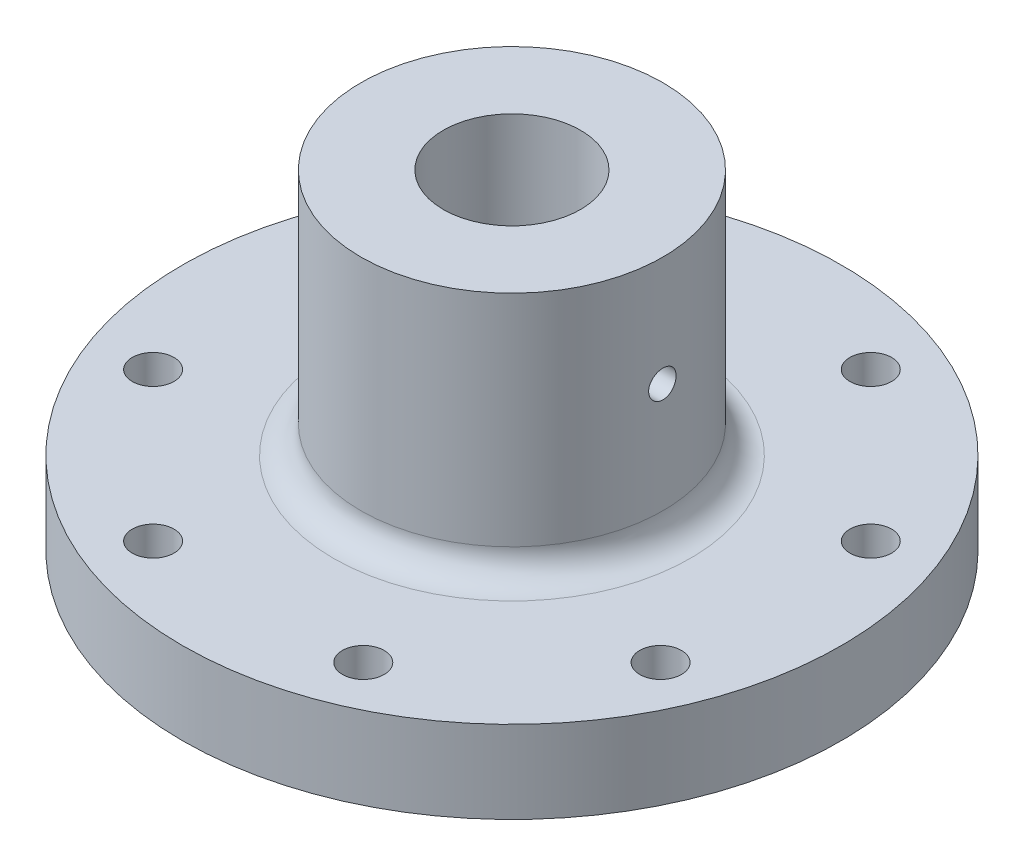
ISO-10303-21;
HEADER;
FILE_DESCRIPTION(('STEP AP214'),'2;1');
FILE_NAME('part.step','',(''),(''),'','','');
FILE_SCHEMA(('AUTOMOTIVE_DESIGN { 1 0 10303 214 1 1 1 1 }'));
ENDSEC;
DATA;
#1=APPLICATION_CONTEXT('core data for automotive mechanical design processes');
#2=APPLICATION_PROTOCOL_DEFINITION('international standard','automotive_design',2000,#1);
#3=PRODUCT_CONTEXT('',#1,'mechanical');
#4=PRODUCT('Part','Part','',(#3));
#5=PRODUCT_RELATED_PRODUCT_CATEGORY('part','',(#4));
#6=PRODUCT_DEFINITION_FORMATION('','',#4);
#7=PRODUCT_DEFINITION_CONTEXT('part definition',#1,'design');
#8=PRODUCT_DEFINITION('design','',#6,#7);
#9=PRODUCT_DEFINITION_SHAPE('','',#8);
#10=(LENGTH_UNIT() NAMED_UNIT(*) SI_UNIT(.MILLI.,.METRE.));
#11=(NAMED_UNIT(*) PLANE_ANGLE_UNIT() SI_UNIT($,.RADIAN.));
#12=(NAMED_UNIT(*) SI_UNIT($,.STERADIAN.) SOLID_ANGLE_UNIT());
#13=UNCERTAINTY_MEASURE_WITH_UNIT(LENGTH_MEASURE(1.E-05),#10,'distance_accuracy_value','');
#14=(GEOMETRIC_REPRESENTATION_CONTEXT(3) GLOBAL_UNCERTAINTY_ASSIGNED_CONTEXT((#13)) GLOBAL_UNIT_ASSIGNED_CONTEXT((#10,
#11,#12)) REPRESENTATION_CONTEXT('',''));
#15=CARTESIAN_POINT('',(0.,0.,0.));
#16=DIRECTION('',(0.,0.,1.));
#17=DIRECTION('',(1.,0.,0.));
#18=AXIS2_PLACEMENT_3D('',#15,#16,#17);
#19=CARTESIAN_POINT('',(0.,38.1,0.));
#20=DIRECTION('',(0.,1.,0.));
#21=DIRECTION('',(0.,0.,1.));
#22=AXIS2_PLACEMENT_3D('',#19,#20,#21);
#23=PLANE('',#22);
#24=CARTESIAN_POINT('',(0.,38.1,0.));
#25=DIRECTION('',(0.,1.,0.));
#26=DIRECTION('',(0.,0.,1.));
#27=AXIS2_PLACEMENT_3D('',#24,#25,#26);
#28=CIRCLE('',#27,7.9375);
#29=CARTESIAN_POINT('',(0.,38.1,7.9375));
#30=VERTEX_POINT('',#29);
#31=EDGE_CURVE('E147',#30,#30,#28,.T.);
#32=ORIENTED_EDGE('',*,*,#31,.F.);
#33=EDGE_LOOP('',(#32));
#34=FACE_BOUND('',#33,.T.);
#35=CARTESIAN_POINT('',(0.,38.1,0.));
#36=DIRECTION('',(0.,1.,0.));
#37=DIRECTION('',(0.,0.,1.));
#38=AXIS2_PLACEMENT_3D('',#35,#36,#37);
#39=CIRCLE('',#38,17.4625);
#40=CARTESIAN_POINT('',(0.,38.1,17.4625));
#41=VERTEX_POINT('',#40);
#42=EDGE_CURVE('E155',#41,#41,#39,.T.);
#43=ORIENTED_EDGE('',*,*,#42,.T.);
#44=EDGE_LOOP('',(#43));
#45=FACE_BOUND('',#44,.T.);
#46=ADVANCED_FACE('F36',(#34,#45),#23,.T.);
#47=CARTESIAN_POINT('',(0.,38.1,0.));
#48=DIRECTION('',(0.,-1.,0.));
#49=DIRECTION('',(0.,0.,-1.));
#50=AXIS2_PLACEMENT_3D('',#47,#48,#49);
#51=CYLINDRICAL_SURFACE('',#50,38.1);
#52=CARTESIAN_POINT('',(0.,0.,0.));
#53=DIRECTION('',(0.,1.,0.));
#54=DIRECTION('',(0.,0.,1.));
#55=AXIS2_PLACEMENT_3D('',#52,#53,#54);
#56=CIRCLE('',#55,38.1);
#57=CARTESIAN_POINT('',(0.,0.,38.1));
#58=VERTEX_POINT('',#57);
#59=EDGE_CURVE('E53',#58,#58,#56,.T.);
#60=ORIENTED_EDGE('',*,*,#59,.T.);
#61=EDGE_LOOP('',(#60));
#62=FACE_BOUND('',#61,.T.);
#63=CARTESIAN_POINT('',(0.,9.525,0.));
#64=DIRECTION('',(0.,1.,0.));
#65=DIRECTION('',(0.,0.,1.));
#66=AXIS2_PLACEMENT_3D('',#63,#64,#65);
#67=CIRCLE('',#66,38.1);
#68=CARTESIAN_POINT('',(0.,9.525,38.1));
#69=VERTEX_POINT('',#68);
#70=EDGE_CURVE('E113',#69,#69,#67,.T.);
#71=ORIENTED_EDGE('',*,*,#70,.F.);
#72=EDGE_LOOP('',(#71));
#73=FACE_BOUND('',#72,.T.);
#74=ADVANCED_FACE('F96',(#62,#73),#51,.T.);
#75=CARTESIAN_POINT('',(-29.3331751572334,38.1,-12.1501989775914));
#76=DIRECTION('',(0.,1.,0.));
#77=DIRECTION('',(0.,0.,1.));
#78=AXIS2_PLACEMENT_3D('',#75,#76,#77);
#79=CYLINDRICAL_SURFACE('',#78,2.41299999999999);
#80=CARTESIAN_POINT('',(-29.3331751572334,0.,-12.1501989775914));
#81=DIRECTION('',(0.,1.,0.));
#82=DIRECTION('',(0.,0.,1.));
#83=AXIS2_PLACEMENT_3D('',#80,#81,#82);
#84=CIRCLE('',#83,2.41299999999999);
#85=CARTESIAN_POINT('',(-29.3331751572334,0.,-9.73719897759142));
#86=VERTEX_POINT('',#85);
#87=EDGE_CURVE('E143',#86,#86,#84,.T.);
#88=ORIENTED_EDGE('',*,*,#87,.F.);
#89=EDGE_LOOP('',(#88));
#90=FACE_BOUND('',#89,.T.);
#91=CARTESIAN_POINT('',(-29.3331751572334,9.525,-12.1501989775914));
#92=DIRECTION('',(0.,1.,0.));
#93=DIRECTION('',(0.,0.,1.));
#94=AXIS2_PLACEMENT_3D('',#91,#92,#93);
#95=CIRCLE('',#94,2.41299999999999);
#96=CARTESIAN_POINT('',(-29.3331751572334,9.525,-9.73719897759142));
#97=VERTEX_POINT('',#96);
#98=EDGE_CURVE('E116',#97,#97,#95,.F.);
#99=ORIENTED_EDGE('',*,*,#98,.F.);
#100=EDGE_LOOP('',(#99));
#101=FACE_BOUND('',#100,.T.);
#102=ADVANCED_FACE('F91',(#90,#101),#79,.F.);
#103=CARTESIAN_POINT('',(-12.1501989775917,38.1,-29.3331751572333));
#104=DIRECTION('',(0.,1.,0.));
#105=DIRECTION('',(0.,0.,1.));
#106=AXIS2_PLACEMENT_3D('',#103,#104,#105);
#107=CYLINDRICAL_SURFACE('',#106,2.41299999999999);
#108=CARTESIAN_POINT('',(-12.1501989775917,0.,-29.3331751572333));
#109=DIRECTION('',(0.,1.,0.));
#110=DIRECTION('',(0.,0.,1.));
#111=AXIS2_PLACEMENT_3D('',#108,#109,#110);
#112=CIRCLE('',#111,2.41299999999999);
#113=CARTESIAN_POINT('',(-12.1501989775917,0.,-26.9201751572333));
#114=VERTEX_POINT('',#113);
#115=EDGE_CURVE('E140',#114,#114,#112,.T.);
#116=ORIENTED_EDGE('',*,*,#115,.F.);
#117=EDGE_LOOP('',(#116));
#118=FACE_BOUND('',#117,.T.);
#119=CARTESIAN_POINT('',(-12.1501989775917,9.525,-29.3331751572333));
#120=DIRECTION('',(0.,1.,0.));
#121=DIRECTION('',(0.,0.,1.));
#122=AXIS2_PLACEMENT_3D('',#119,#120,#121);
#123=CIRCLE('',#122,2.41299999999999);
#124=CARTESIAN_POINT('',(-12.1501989775917,9.525,-26.9201751572333));
#125=VERTEX_POINT('',#124);
#126=EDGE_CURVE('E122',#125,#125,#123,.F.);
#127=ORIENTED_EDGE('',*,*,#126,.F.);
#128=EDGE_LOOP('',(#127));
#129=FACE_BOUND('',#128,.T.);
#130=ADVANCED_FACE('F106',(#118,#129),#107,.F.);
#131=CARTESIAN_POINT('',(12.1501989775915,38.1,-29.3331751572334));
#132=DIRECTION('',(0.,1.,0.));
#133=DIRECTION('',(0.,0.,1.));
#134=AXIS2_PLACEMENT_3D('',#131,#132,#133);
#135=CYLINDRICAL_SURFACE('',#134,2.41299999999999);
#136=CARTESIAN_POINT('',(12.1501989775915,0.,-29.3331751572334));
#137=DIRECTION('',(0.,1.,0.));
#138=DIRECTION('',(0.,0.,1.));
#139=AXIS2_PLACEMENT_3D('',#136,#137,#138);
#140=CIRCLE('',#139,2.41299999999999);
#141=CARTESIAN_POINT('',(12.1501989775915,0.,-26.9201751572334));
#142=VERTEX_POINT('',#141);
#143=EDGE_CURVE('E137',#142,#142,#140,.T.);
#144=ORIENTED_EDGE('',*,*,#143,.F.);
#145=EDGE_LOOP('',(#144));
#146=FACE_BOUND('',#145,.T.);
#147=CARTESIAN_POINT('',(12.1501989775915,9.525,-29.3331751572334));
#148=DIRECTION('',(0.,1.,0.));
#149=DIRECTION('',(0.,0.,1.));
#150=AXIS2_PLACEMENT_3D('',#147,#148,#149);
#151=CIRCLE('',#150,2.41299999999999);
#152=CARTESIAN_POINT('',(12.1501989775915,9.525,-26.9201751572334));
#153=VERTEX_POINT('',#152);
#154=EDGE_CURVE('E174',#153,#153,#151,.F.);
#155=ORIENTED_EDGE('',*,*,#154,.F.);
#156=EDGE_LOOP('',(#155));
#157=FACE_BOUND('',#156,.T.);
#158=ADVANCED_FACE('F182',(#146,#157),#135,.F.);
#159=CARTESIAN_POINT('',(29.3331751572333,38.1,-12.1501989775916));
#160=DIRECTION('',(0.,1.,0.));
#161=DIRECTION('',(0.,0.,1.));
#162=AXIS2_PLACEMENT_3D('',#159,#160,#161);
#163=CYLINDRICAL_SURFACE('',#162,2.41299999999999);
#164=CARTESIAN_POINT('',(29.3331751572333,0.,-12.1501989775916));
#165=DIRECTION('',(0.,1.,0.));
#166=DIRECTION('',(0.,0.,1.));
#167=AXIS2_PLACEMENT_3D('',#164,#165,#166);
#168=CIRCLE('',#167,2.41299999999999);
#169=CARTESIAN_POINT('',(29.3331751572333,0.,-9.73719897759164));
#170=VERTEX_POINT('',#169);
#171=EDGE_CURVE('E134',#170,#170,#168,.T.);
#172=ORIENTED_EDGE('',*,*,#171,.F.);
#173=EDGE_LOOP('',(#172));
#174=FACE_BOUND('',#173,.T.);
#175=CARTESIAN_POINT('',(29.3331751572333,9.525,-12.1501989775916));
#176=DIRECTION('',(0.,1.,0.));
#177=DIRECTION('',(0.,0.,1.));
#178=AXIS2_PLACEMENT_3D('',#175,#176,#177);
#179=CIRCLE('',#178,2.41299999999999);
#180=CARTESIAN_POINT('',(29.3331751572333,9.525,-9.73719897759164));
#181=VERTEX_POINT('',#180);
#182=EDGE_CURVE('E171',#181,#181,#179,.F.);
#183=ORIENTED_EDGE('',*,*,#182,.F.);
#184=EDGE_LOOP('',(#183));
#185=FACE_BOUND('',#184,.T.);
#186=ADVANCED_FACE('F187',(#174,#185),#163,.F.);
#187=CARTESIAN_POINT('',(29.3331751572334,38.1,12.1501989775914));
#188=DIRECTION('',(0.,1.,0.));
#189=DIRECTION('',(0.,0.,1.));
#190=AXIS2_PLACEMENT_3D('',#187,#188,#189);
#191=CYLINDRICAL_SURFACE('',#190,2.41299999999999);
#192=CARTESIAN_POINT('',(29.3331751572334,0.,12.1501989775914));
#193=DIRECTION('',(0.,1.,0.));
#194=DIRECTION('',(0.,0.,1.));
#195=AXIS2_PLACEMENT_3D('',#192,#193,#194);
#196=CIRCLE('',#195,2.41299999999999);
#197=CARTESIAN_POINT('',(29.3331751572334,0.,14.5631989775914));
#198=VERTEX_POINT('',#197);
#199=EDGE_CURVE('E131',#198,#198,#196,.T.);
#200=ORIENTED_EDGE('',*,*,#199,.F.);
#201=EDGE_LOOP('',(#200));
#202=FACE_BOUND('',#201,.T.);
#203=CARTESIAN_POINT('',(29.3331751572334,9.525,12.1501989775914));
#204=DIRECTION('',(0.,1.,0.));
#205=DIRECTION('',(0.,0.,1.));
#206=AXIS2_PLACEMENT_3D('',#203,#204,#205);
#207=CIRCLE('',#206,2.41299999999999);
#208=CARTESIAN_POINT('',(29.3331751572334,9.525,14.5631989775914));
#209=VERTEX_POINT('',#208);
#210=EDGE_CURVE('E168',#209,#209,#207,.F.);
#211=ORIENTED_EDGE('',*,*,#210,.F.);
#212=EDGE_LOOP('',(#211));
#213=FACE_BOUND('',#212,.T.);
#214=ADVANCED_FACE('F194',(#202,#213),#191,.F.);
#215=CARTESIAN_POINT('',(12.1501989775915,38.1,29.3331751572334));
#216=DIRECTION('',(0.,1.,0.));
#217=DIRECTION('',(0.,0.,1.));
#218=AXIS2_PLACEMENT_3D('',#215,#216,#217);
#219=CYLINDRICAL_SURFACE('',#218,2.41299999999999);
#220=CARTESIAN_POINT('',(12.1501989775915,0.,29.3331751572334));
#221=DIRECTION('',(0.,1.,0.));
#222=DIRECTION('',(0.,0.,1.));
#223=AXIS2_PLACEMENT_3D('',#220,#221,#222);
#224=CIRCLE('',#223,2.41299999999999);
#225=CARTESIAN_POINT('',(12.1501989775915,0.,31.7461751572334));
#226=VERTEX_POINT('',#225);
#227=EDGE_CURVE('E128',#226,#226,#224,.T.);
#228=ORIENTED_EDGE('',*,*,#227,.F.);
#229=EDGE_LOOP('',(#228));
#230=FACE_BOUND('',#229,.T.);
#231=CARTESIAN_POINT('',(12.1501989775915,9.525,29.3331751572334));
#232=DIRECTION('',(0.,1.,0.));
#233=DIRECTION('',(0.,0.,1.));
#234=AXIS2_PLACEMENT_3D('',#231,#232,#233);
#235=CIRCLE('',#234,2.41299999999999);
#236=CARTESIAN_POINT('',(12.1501989775915,9.525,31.7461751572334));
#237=VERTEX_POINT('',#236);
#238=EDGE_CURVE('E159',#237,#237,#235,.F.);
#239=ORIENTED_EDGE('',*,*,#238,.F.);
#240=EDGE_LOOP('',(#239));
#241=FACE_BOUND('',#240,.T.);
#242=ADVANCED_FACE('F198',(#230,#241),#219,.F.);
#243=CARTESIAN_POINT('',(-12.1501989775917,38.1,29.3331751572333));
#244=DIRECTION('',(0.,1.,0.));
#245=DIRECTION('',(0.,0.,1.));
#246=AXIS2_PLACEMENT_3D('',#243,#244,#245);
#247=CYLINDRICAL_SURFACE('',#246,2.41299999999999);
#248=CARTESIAN_POINT('',(-12.1501989775917,0.,29.3331751572333));
#249=DIRECTION('',(0.,1.,0.));
#250=DIRECTION('',(0.,0.,1.));
#251=AXIS2_PLACEMENT_3D('',#248,#249,#250);
#252=CIRCLE('',#251,2.41299999999999);
#253=CARTESIAN_POINT('',(-12.1501989775917,0.,31.7461751572333));
#254=VERTEX_POINT('',#253);
#255=EDGE_CURVE('E119',#254,#254,#252,.T.);
#256=ORIENTED_EDGE('',*,*,#255,.F.);
#257=EDGE_LOOP('',(#256));
#258=FACE_BOUND('',#257,.T.);
#259=CARTESIAN_POINT('',(-12.1501989775917,9.525,29.3331751572333));
#260=DIRECTION('',(0.,1.,0.));
#261=DIRECTION('',(0.,0.,1.));
#262=AXIS2_PLACEMENT_3D('',#259,#260,#261);
#263=CIRCLE('',#262,2.41299999999999);
#264=CARTESIAN_POINT('',(-12.1501989775917,9.525,31.7461751572333));
#265=VERTEX_POINT('',#264);
#266=EDGE_CURVE('E154',#265,#265,#263,.F.);
#267=ORIENTED_EDGE('',*,*,#266,.F.);
#268=EDGE_LOOP('',(#267));
#269=FACE_BOUND('',#268,.T.);
#270=ADVANCED_FACE('F202',(#258,#269),#247,.F.);
#271=CARTESIAN_POINT('',(-29.3331751572334,38.1,12.1501989775914));
#272=DIRECTION('',(0.,1.,0.));
#273=DIRECTION('',(0.,0.,1.));
#274=AXIS2_PLACEMENT_3D('',#271,#272,#273);
#275=CYLINDRICAL_SURFACE('',#274,2.41299999999999);
#276=CARTESIAN_POINT('',(-29.3331751572334,0.,12.1501989775914));
#277=DIRECTION('',(0.,1.,0.));
#278=DIRECTION('',(0.,0.,1.));
#279=AXIS2_PLACEMENT_3D('',#276,#277,#278);
#280=CIRCLE('',#279,2.41299999999999);
#281=CARTESIAN_POINT('',(-29.3331751572334,0.,14.5631989775914));
#282=VERTEX_POINT('',#281);
#283=EDGE_CURVE('E115',#282,#282,#280,.T.);
#284=ORIENTED_EDGE('',*,*,#283,.F.);
#285=EDGE_LOOP('',(#284));
#286=FACE_BOUND('',#285,.T.);
#287=CARTESIAN_POINT('',(-29.3331751572334,9.525,12.1501989775914));
#288=DIRECTION('',(0.,1.,0.));
#289=DIRECTION('',(0.,0.,1.));
#290=AXIS2_PLACEMENT_3D('',#287,#288,#289);
#291=CIRCLE('',#290,2.41299999999999);
#292=CARTESIAN_POINT('',(-29.3331751572334,9.525,14.5631989775914));
#293=VERTEX_POINT('',#292);
#294=EDGE_CURVE('E152',#293,#293,#291,.F.);
#295=ORIENTED_EDGE('',*,*,#294,.F.);
#296=EDGE_LOOP('',(#295));
#297=FACE_BOUND('',#296,.T.);
#298=ADVANCED_FACE('F99',(#286,#297),#275,.F.);
#299=CARTESIAN_POINT('',(0.,0.,0.));
#300=DIRECTION('',(0.,1.,0.));
#301=DIRECTION('',(0.,0.,1.));
#302=AXIS2_PLACEMENT_3D('',#299,#300,#301);
#303=PLANE('',#302);
#304=ORIENTED_EDGE('',*,*,#283,.T.);
#305=EDGE_LOOP('',(#304));
#306=FACE_BOUND('',#305,.T.);
#307=ORIENTED_EDGE('',*,*,#255,.T.);
#308=EDGE_LOOP('',(#307));
#309=FACE_BOUND('',#308,.T.);
#310=ORIENTED_EDGE('',*,*,#227,.T.);
#311=EDGE_LOOP('',(#310));
#312=FACE_BOUND('',#311,.T.);
#313=ORIENTED_EDGE('',*,*,#199,.T.);
#314=EDGE_LOOP('',(#313));
#315=FACE_BOUND('',#314,.T.);
#316=ORIENTED_EDGE('',*,*,#171,.T.);
#317=EDGE_LOOP('',(#316));
#318=FACE_BOUND('',#317,.T.);
#319=ORIENTED_EDGE('',*,*,#143,.T.);
#320=EDGE_LOOP('',(#319));
#321=FACE_BOUND('',#320,.T.);
#322=ORIENTED_EDGE('',*,*,#115,.T.);
#323=EDGE_LOOP('',(#322));
#324=FACE_BOUND('',#323,.T.);
#325=ORIENTED_EDGE('',*,*,#87,.T.);
#326=EDGE_LOOP('',(#325));
#327=FACE_BOUND('',#326,.T.);
#328=ORIENTED_EDGE('',*,*,#59,.F.);
#329=EDGE_LOOP('',(#328));
#330=FACE_BOUND('',#329,.T.);
#331=CARTESIAN_POINT('',(0.,0.,0.));
#332=DIRECTION('',(0.,1.,0.));
#333=DIRECTION('',(0.,0.,1.));
#334=AXIS2_PLACEMENT_3D('',#331,#332,#333);
#335=CIRCLE('',#334,7.9375);
#336=CARTESIAN_POINT('',(0.,0.,7.9375));
#337=VERTEX_POINT('',#336);
#338=EDGE_CURVE('E146',#337,#337,#335,.T.);
#339=ORIENTED_EDGE('',*,*,#338,.T.);
#340=EDGE_LOOP('',(#339));
#341=FACE_BOUND('',#340,.T.);
#342=ADVANCED_FACE('F89',(#306,#309,#312,#315,#318,#321,#324,#327,#330,#341),#303,.F.);
#343=CARTESIAN_POINT('',(0.,38.1,0.));
#344=DIRECTION('',(0.,-1.,0.));
#345=DIRECTION('',(0.,0.,-1.));
#346=AXIS2_PLACEMENT_3D('',#343,#344,#345);
#347=CYLINDRICAL_SURFACE('',#346,7.9375);
#348=CARTESIAN_POINT('',(-7.77712993333659,25.4,-1.5875));
#349=CARTESIAN_POINT('',(-7.77713168703087,25.4882084460912,-1.5874967390764));
#350=CARTESIAN_POINT('',(-7.77864694376105,25.5764579645414,-1.5801231601024));
#351=CARTESIAN_POINT('',(-7.78453534696949,25.750460476915,-1.55084825018792));
#352=CARTESIAN_POINT('',(-7.78891078017473,25.8362114158597,-1.52893529472445));
#353=CARTESIAN_POINT('',(-7.80000462033321,26.0026742190747,-1.4712883049088));
#354=CARTESIAN_POINT('',(-7.80672069623424,26.083391002933,-1.43556801746727));
#355=CARTESIAN_POINT('',(-7.82173631675578,26.2376838159564,-1.35135795842694));
#356=CARTESIAN_POINT('',(-7.83003577299128,26.3112602433539,-1.30286889952933));
#357=CARTESIAN_POINT('',(-7.84741413264617,26.450228093618,-1.19376678259983));
#358=CARTESIAN_POINT('',(-7.85650158816626,26.5155038457658,-1.13300772876239));
#359=CARTESIAN_POINT('',(-7.87435674780377,26.6350075845566,-1.00140577757133));
#360=CARTESIAN_POINT('',(-7.88312442947196,26.6892347967748,-0.93056217395255));
#361=CARTESIAN_POINT('',(-7.89944439312879,26.7855509779852,-0.780036152529756));
#362=CARTESIAN_POINT('',(-7.90698541538461,26.8275300281839,-0.700282076179634));
#363=CARTESIAN_POINT('',(-7.91990632302765,26.8974489625639,-0.534676588739793));
#364=CARTESIAN_POINT('',(-7.92528641070039,26.9253901608928,-0.448825749255127));
#365=CARTESIAN_POINT('',(-7.93321884092864,26.9660801698712,-0.274664127579609));
#366=CARTESIAN_POINT('',(-7.93580750732402,26.979024301894,-0.186400661003517));
#367=CARTESIAN_POINT('',(-7.93799087378971,26.9899621360433,-0.00891947739458822));
#368=CARTESIAN_POINT('',(-7.93758586236255,26.9879572788127,0.0802981468580516));
#369=CARTESIAN_POINT('',(-7.93385565353768,26.9692021889078,0.255812926180447));
#370=CARTESIAN_POINT('',(-7.93057212405768,26.952662348746,0.342133577698821));
#371=CARTESIAN_POINT('',(-7.92150081240561,26.9056405109715,0.510748957196227));
#372=CARTESIAN_POINT('',(-7.91571293003662,26.8751579555204,0.593043523948567));
#373=CARTESIAN_POINT('',(-7.90221457431684,26.8009210612662,0.751870897831408));
#374=CARTESIAN_POINT('',(-7.89449221478167,26.757084295121,0.828364126437565));
#375=CARTESIAN_POINT('',(-7.87797620289634,26.6574443398869,0.972986760302361));
#376=CARTESIAN_POINT('',(-7.86918242732665,26.6016397738643,1.04111520174594));
#377=CARTESIAN_POINT('',(-7.8513140592858,26.4784941249028,1.16832289679736));
#378=CARTESIAN_POINT('',(-7.84223724376307,26.4109689160668,1.22722372756064));
#379=CARTESIAN_POINT('',(-7.82497119913033,26.2669076476094,1.33289435791818));
#380=CARTESIAN_POINT('',(-7.8167819868097,26.1903714175979,1.3796639280678));
#381=CARTESIAN_POINT('',(-7.80221400363266,26.0302044294829,1.45980596849799));
#382=CARTESIAN_POINT('',(-7.79583914482134,25.946558838872,1.49314955334711));
#383=CARTESIAN_POINT('',(-7.7856790616002,25.7746955235882,1.54525716733379));
#384=CARTESIAN_POINT('',(-7.78189349968879,25.6864783964047,1.56402309663742));
#385=CARTESIAN_POINT('',(-7.77740823337676,25.5095932879265,1.58617603458223));
#386=CARTESIAN_POINT('',(-7.77665683453232,25.4209588507823,1.58982070100043));
#387=CARTESIAN_POINT('',(-7.77818621031056,25.2443484456705,1.5823209849433));
#388=CARTESIAN_POINT('',(-7.78046681299366,25.1563724406488,1.57117744108188));
#389=CARTESIAN_POINT('',(-7.78775481585677,24.9844422835361,1.53463975531772));
#390=CARTESIAN_POINT('',(-7.79273585935514,24.9004576554307,1.50938328558238));
#391=CARTESIAN_POINT('',(-7.80484039345768,24.7379120445419,1.44548389355227));
#392=CARTESIAN_POINT('',(-7.81196406054453,24.6593515091833,1.40683986851742));
#393=CARTESIAN_POINT('',(-7.82766731964738,24.5087566879541,1.31667907576726));
#394=CARTESIAN_POINT('',(-7.83626467835534,24.4368208139974,1.26500108629762));
#395=CARTESIAN_POINT('',(-7.85389786574785,24.3025480546986,1.15045422088768));
#396=CARTESIAN_POINT('',(-7.86293373949061,24.2402121585293,1.08758419316695));
#397=CARTESIAN_POINT('',(-7.8805936156738,24.1259319372929,0.951281234177903));
#398=CARTESIAN_POINT('',(-7.88920916612536,24.0741618232431,0.877700967050788));
#399=CARTESIAN_POINT('',(-7.90491065110434,23.9837184131194,0.722737785907675));
#400=CARTESIAN_POINT('',(-7.91199664986397,23.9450445670402,0.641355199750693));
#401=CARTESIAN_POINT('',(-7.92380454321944,23.8821454161022,0.47355550580812));
#402=CARTESIAN_POINT('',(-7.92853981888884,23.8578381773158,0.387170094146449));
#403=CARTESIAN_POINT('',(-7.93517012051035,23.8241026443337,0.211438259304361));
#404=CARTESIAN_POINT('',(-7.93706548854751,23.8146725580824,0.122092194079053));
#405=CARTESIAN_POINT('',(-7.93779432970917,23.8110284177214,-0.055360719072002));
#406=CARTESIAN_POINT('',(-7.93668050947094,23.8165524422758,-0.143462076774635));
#407=CARTESIAN_POINT('',(-7.93162694152004,23.8420813964947,-0.317454012213581));
#408=CARTESIAN_POINT('',(-7.92768722934033,23.8620861440776,-0.403344617733985));
#409=CARTESIAN_POINT('',(-7.91742603654438,23.9158922749455,-0.57031374022034));
#410=CARTESIAN_POINT('',(-7.91110999131058,23.9496621877833,-0.651402753643946));
#411=CARTESIAN_POINT('',(-7.89677621370873,24.0300069331128,-0.8068011870452));
#412=CARTESIAN_POINT('',(-7.88875834687843,24.0765827774971,-0.881110070655765));
#413=CARTESIAN_POINT('',(-7.87173938663104,24.1821007769611,-1.02213392554384));
#414=CARTESIAN_POINT('',(-7.86272451807605,24.241230309014,-1.08870704933494));
#415=CARTESIAN_POINT('',(-7.84480941359547,24.369792256152,-1.21107615568899));
#416=CARTESIAN_POINT('',(-7.83590920532487,24.4392271080316,-1.26686958208432));
#417=CARTESIAN_POINT('',(-7.81912556615392,24.5873259152616,-1.36666639838512));
#418=CARTESIAN_POINT('',(-7.81125412014076,24.6660812258422,-1.41053631824059));
#419=CARTESIAN_POINT('',(-7.79756564030962,24.8299807776131,-1.48435067824443));
#420=CARTESIAN_POINT('',(-7.79174674404867,24.9151191414324,-1.51430775049227));
#421=CARTESIAN_POINT('',(-7.7839836879034,25.067041648006,-1.55363725951854));
#422=CARTESIAN_POINT('',(-7.78142946047614,25.1329593534758,-1.56631306390487));
#423=CARTESIAN_POINT('',(-7.77800194558119,25.2659101528525,-1.58324552851252));
#424=CARTESIAN_POINT('',(-7.77712860016367,25.3329432082264,-1.58750247898114));
#425=CARTESIAN_POINT('',(-7.77712993333659,25.4,-1.5875));
#426=B_SPLINE_CURVE_WITH_KNOTS('',3,(#348,#349,#350,#351,#352,#353,#354,#355,#356,#357,#358,
#359,#360,#361,#362,#363,#364,#365,#366,#367,#368,#369,#370,#371,#372,#373,#374,#375,#376,#377,
#378,#379,#380,#381,#382,#383,#384,#385,#386,#387,#388,#389,#390,#391,#392,#393,#394,#395,#396,
#397,#398,#399,#400,#401,#402,#403,#404,#405,#406,#407,#408,#409,#410,#411,#412,#413,#414,#415,
#416,#417,#418,#419,#420,#421,#422,#423,#424,#425),.UNSPECIFIED.,.T.,.F.,(4,2,2,2,2,2,2,2,2,2,2,
2,2,2,2,2,2,2,2,2,2,2,2,2,2,2,2,2,2,2,2,2,2,2,2,2,2,2,4),(0.,0.26437981139272,0.52897125486382,
0.793299940480679,1.05761387546503,1.32528075920643,1.59296639806232,1.86298523194452,
2.13297878341414,2.3994149510189,2.66582544234544,2.92844203543241,3.19106913654578,
3.45535129702906,3.7196638803498,3.98858337985442,4.25750796519818,4.52700807786783,
4.79647305587939,5.06132715514792,5.32616623563869,5.58846580081019,5.85078697687608,
6.11652732392052,6.38229503431456,6.65214255251853,6.92197873650291,7.19026079056107,
7.45851052572959,7.72209240145814,7.98567096294726,8.2486502710728,8.51165036513811,
8.77889328840634,9.04619950487527,9.31638501494227,9.5863247295368,9.78731538273572,
9.9882991064869),.UNSPECIFIED.);
#427=CARTESIAN_POINT('',(-7.77712993333659,25.4,-1.5875));
#428=VERTEX_POINT('',#427);
#429=EDGE_CURVE('E80',#428,#428,#426,.T.);
#430=ORIENTED_EDGE('',*,*,#429,.F.);
#431=EDGE_LOOP('',(#430));
#432=FACE_BOUND('',#431,.T.);
#433=CARTESIAN_POINT('',(7.77712993333659,25.4,-1.5875));
#434=CARTESIAN_POINT('',(7.77713168703087,25.3117915539088,-1.5874967390764));
#435=CARTESIAN_POINT('',(7.77864694376105,25.2235420354586,-1.5801231601024));
#436=CARTESIAN_POINT('',(7.78453534696949,25.049539523085,-1.55084825018792));
#437=CARTESIAN_POINT('',(7.78891078017473,24.9637885841403,-1.52893529472445));
#438=CARTESIAN_POINT('',(7.80000462033321,24.7973257809253,-1.4712883049088));
#439=CARTESIAN_POINT('',(7.80672069623424,24.716608997067,-1.43556801746727));
#440=CARTESIAN_POINT('',(7.82173631675578,24.5623161840436,-1.35135795842694));
#441=CARTESIAN_POINT('',(7.83003577299128,24.4887397566461,-1.30286889952933));
#442=CARTESIAN_POINT('',(7.84741413264617,24.349771906382,-1.19376678259983));
#443=CARTESIAN_POINT('',(7.85650158816626,24.2844961542342,-1.13300772876239));
#444=CARTESIAN_POINT('',(7.87435674780377,24.1649924154434,-1.00140577757133));
#445=CARTESIAN_POINT('',(7.88312442947196,24.1107652032252,-0.930562173952551));
#446=CARTESIAN_POINT('',(7.89944439312879,24.0144490220148,-0.780036152529757));
#447=CARTESIAN_POINT('',(7.90698541538461,23.9724699718161,-0.700282076179636));
#448=CARTESIAN_POINT('',(7.91990632302765,23.9025510374361,-0.534676588739796));
#449=CARTESIAN_POINT('',(7.92528641070039,23.8746098391072,-0.44882574925513));
#450=CARTESIAN_POINT('',(7.93321884092864,23.8339198301288,-0.274664127579612));
#451=CARTESIAN_POINT('',(7.93580750732402,23.820975698106,-0.186400661003519));
#452=CARTESIAN_POINT('',(7.93799087378971,23.8100378639567,-0.00891947739459044));
#453=CARTESIAN_POINT('',(7.93758586236255,23.8120427211873,0.0802981468580495));
#454=CARTESIAN_POINT('',(7.93385565353768,23.8307978110922,0.255812926180445));
#455=CARTESIAN_POINT('',(7.93057212405768,23.847337651254,0.34213357769882));
#456=CARTESIAN_POINT('',(7.92150081240561,23.8943594890285,0.510748957196227));
#457=CARTESIAN_POINT('',(7.91571293003662,23.9248420444796,0.593043523948567));
#458=CARTESIAN_POINT('',(7.90221457431684,23.9990789387338,0.751870897831408));
#459=CARTESIAN_POINT('',(7.89449221478167,24.042915704879,0.828364126437565));
#460=CARTESIAN_POINT('',(7.87797620289634,24.1425556601131,0.972986760302362));
#461=CARTESIAN_POINT('',(7.86918242732665,24.1983602261357,1.04111520174594));
#462=CARTESIAN_POINT('',(7.8513140592858,24.3215058750972,1.16832289679736));
#463=CARTESIAN_POINT('',(7.84223724376307,24.3890310839332,1.22722372756064));
#464=CARTESIAN_POINT('',(7.82497119913033,24.5330923523906,1.33289435791818));
#465=CARTESIAN_POINT('',(7.8167819868097,24.6096285824021,1.3796639280678));
#466=CARTESIAN_POINT('',(7.80221400363266,24.7697955705171,1.45980596849799));
#467=CARTESIAN_POINT('',(7.79583914482134,24.853441161128,1.49314955334711));
#468=CARTESIAN_POINT('',(7.7856790616002,25.0253044764118,1.54525716733379));
#469=CARTESIAN_POINT('',(7.78189349968879,25.1135216035953,1.56402309663742));
#470=CARTESIAN_POINT('',(7.77740823337676,25.2904067120735,1.58617603458223));
#471=CARTESIAN_POINT('',(7.77665683453232,25.3790411492177,1.58982070100043));
#472=CARTESIAN_POINT('',(7.77818621031056,25.5556515543295,1.5823209849433));
#473=CARTESIAN_POINT('',(7.78046681299366,25.6436275593512,1.57117744108188));
#474=CARTESIAN_POINT('',(7.78775481585677,25.8155577164639,1.53463975531772));
#475=CARTESIAN_POINT('',(7.79273585935514,25.8995423445693,1.50938328558238));
#476=CARTESIAN_POINT('',(7.80484039345768,26.0620879554581,1.44548389355227));
#477=CARTESIAN_POINT('',(7.81196406054453,26.1406484908167,1.40683986851742));
#478=CARTESIAN_POINT('',(7.82766731964738,26.2912433120459,1.31667907576726));
#479=CARTESIAN_POINT('',(7.83626467835534,26.3631791860026,1.26500108629762));
#480=CARTESIAN_POINT('',(7.85389786574785,26.4974519453015,1.15045422088768));
#481=CARTESIAN_POINT('',(7.86293373949061,26.5597878414707,1.08758419316695));
#482=CARTESIAN_POINT('',(7.8805936156738,26.6740680627071,0.951281234177902));
#483=CARTESIAN_POINT('',(7.88920916612536,26.7258381767569,0.877700967050788));
#484=CARTESIAN_POINT('',(7.90491065110434,26.8162815868806,0.722737785907675));
#485=CARTESIAN_POINT('',(7.91199664986397,26.8549554329598,0.641355199750694));
#486=CARTESIAN_POINT('',(7.92380454321944,26.9178545838978,0.473555505808122));
#487=CARTESIAN_POINT('',(7.92853981888884,26.9421618226842,0.38717009414645));
#488=CARTESIAN_POINT('',(7.93517012051035,26.9758973556664,0.211438259304361));
#489=CARTESIAN_POINT('',(7.93706548854751,26.9853274419176,0.122092194079053));
#490=CARTESIAN_POINT('',(7.93779432970917,26.9889715822786,-0.0553607190720018));
#491=CARTESIAN_POINT('',(7.93668050947094,26.9834475577242,-0.143462076774635));
#492=CARTESIAN_POINT('',(7.93162694152004,26.9579186035053,-0.317454012213581));
#493=CARTESIAN_POINT('',(7.92768722934034,26.9379138559224,-0.403344617733984));
#494=CARTESIAN_POINT('',(7.91742603654438,26.8841077250545,-0.57031374022034));
#495=CARTESIAN_POINT('',(7.91110999131058,26.8503378122167,-0.651402753643946));
#496=CARTESIAN_POINT('',(7.89677621370873,26.7699930668872,-0.806801187045201));
#497=CARTESIAN_POINT('',(7.88875834687843,26.7234172225029,-0.881110070655766));
#498=CARTESIAN_POINT('',(7.87173938663104,26.6178992230389,-1.02213392554384));
#499=CARTESIAN_POINT('',(7.86272451807605,26.558769690986,-1.08870704933495));
#500=CARTESIAN_POINT('',(7.84480941359547,26.430207743848,-1.211076155689));
#501=CARTESIAN_POINT('',(7.83590920532487,26.3607728919684,-1.26686958208432));
#502=CARTESIAN_POINT('',(7.81912556615392,26.2126740847384,-1.36666639838512));
#503=CARTESIAN_POINT('',(7.81125412014076,26.1339187741578,-1.41053631824059));
#504=CARTESIAN_POINT('',(7.79756564030962,25.9700192223869,-1.48435067824443));
#505=CARTESIAN_POINT('',(7.79174674404867,25.8848808585676,-1.51430775049227));
#506=CARTESIAN_POINT('',(7.7839836879034,25.732958351994,-1.55363725951854));
#507=CARTESIAN_POINT('',(7.78142946047614,25.6670406465242,-1.56631306390487));
#508=CARTESIAN_POINT('',(7.77800194558119,25.5340898471475,-1.58324552851252));
#509=CARTESIAN_POINT('',(7.77712860016367,25.4670567917736,-1.58750247898114));
#510=CARTESIAN_POINT('',(7.77712993333659,25.4,-1.5875));
#511=B_SPLINE_CURVE_WITH_KNOTS('',3,(#433,#434,#435,#436,#437,#438,#439,#440,#441,#442,#443,
#444,#445,#446,#447,#448,#449,#450,#451,#452,#453,#454,#455,#456,#457,#458,#459,#460,#461,#462,
#463,#464,#465,#466,#467,#468,#469,#470,#471,#472,#473,#474,#475,#476,#477,#478,#479,#480,#481,
#482,#483,#484,#485,#486,#487,#488,#489,#490,#491,#492,#493,#494,#495,#496,#497,#498,#499,#500,
#501,#502,#503,#504,#505,#506,#507,#508,#509,#510),.UNSPECIFIED.,.T.,.F.,(4,2,2,2,2,2,2,2,2,2,2,
2,2,2,2,2,2,2,2,2,2,2,2,2,2,2,2,2,2,2,2,2,2,2,2,2,2,2,4),(0.,0.26437981139272,0.52897125486382,
0.793299940480679,1.05761387546503,1.32528075920643,1.59296639806232,1.86298523194452,
2.13297878341413,2.3994149510189,2.66582544234544,2.9284420354324,3.19106913654578,
3.45535129702906,3.7196638803498,3.98858337985442,4.25750796519818,4.52700807786783,
4.7964730558794,5.06132715514792,5.32616623563869,5.58846580081019,5.85078697687607,
6.11652732392052,6.38229503431456,6.65214255251852,6.92197873650291,7.19026079056107,
7.45851052572959,7.72209240145814,7.98567096294726,8.24865027107279,8.51165036513811,
8.77889328840635,9.04619950487527,9.31638501494227,9.5863247295368,9.78731538273571,
9.9882991064869),.UNSPECIFIED.);
#512=CARTESIAN_POINT('',(7.77712993333659,25.4,-1.5875));
#513=VERTEX_POINT('',#512);
#514=EDGE_CURVE('E75',#513,#513,#511,.T.);
#515=ORIENTED_EDGE('',*,*,#514,.F.);
#516=EDGE_LOOP('',(#515));
#517=FACE_BOUND('',#516,.T.);
#518=ORIENTED_EDGE('',*,*,#31,.T.);
#519=EDGE_LOOP('',(#518));
#520=FACE_BOUND('',#519,.T.);
#521=ORIENTED_EDGE('',*,*,#338,.F.);
#522=EDGE_LOOP('',(#521));
#523=FACE_BOUND('',#522,.T.);
#524=ADVANCED_FACE('F84',(#432,#517,#520,#523),#347,.F.);
#525=CARTESIAN_POINT('',(0.,9.525,0.));
#526=DIRECTION('',(0.,1.,0.));
#527=DIRECTION('',(0.,0.,1.));
#528=AXIS2_PLACEMENT_3D('',#525,#526,#527);
#529=PLANE('',#528);
#530=CARTESIAN_POINT('',(0.,9.525,0.));
#531=DIRECTION('',(0.,1.,0.));
#532=DIRECTION('',(0.,0.,1.));
#533=AXIS2_PLACEMENT_3D('',#530,#531,#532);
#534=CIRCLE('',#533,20.6375);
#535=CARTESIAN_POINT('',(0.,9.525,20.6375));
#536=VERTEX_POINT('',#535);
#537=EDGE_CURVE('E48',#536,#536,#534,.F.);
#538=ORIENTED_EDGE('',*,*,#537,.T.);
#539=EDGE_LOOP('',(#538));
#540=FACE_BOUND('',#539,.T.);
#541=ORIENTED_EDGE('',*,*,#98,.T.);
#542=EDGE_LOOP('',(#541));
#543=FACE_BOUND('',#542,.T.);
#544=ORIENTED_EDGE('',*,*,#126,.T.);
#545=EDGE_LOOP('',(#544));
#546=FACE_BOUND('',#545,.T.);
#547=ORIENTED_EDGE('',*,*,#154,.T.);
#548=EDGE_LOOP('',(#547));
#549=FACE_BOUND('',#548,.T.);
#550=ORIENTED_EDGE('',*,*,#182,.T.);
#551=EDGE_LOOP('',(#550));
#552=FACE_BOUND('',#551,.T.);
#553=ORIENTED_EDGE('',*,*,#210,.T.);
#554=EDGE_LOOP('',(#553));
#555=FACE_BOUND('',#554,.T.);
#556=ORIENTED_EDGE('',*,*,#238,.T.);
#557=EDGE_LOOP('',(#556));
#558=FACE_BOUND('',#557,.T.);
#559=ORIENTED_EDGE('',*,*,#266,.T.);
#560=EDGE_LOOP('',(#559));
#561=FACE_BOUND('',#560,.T.);
#562=ORIENTED_EDGE('',*,*,#294,.T.);
#563=EDGE_LOOP('',(#562));
#564=FACE_BOUND('',#563,.T.);
#565=ORIENTED_EDGE('',*,*,#70,.T.);
#566=EDGE_LOOP('',(#565));
#567=FACE_BOUND('',#566,.T.);
#568=ADVANCED_FACE('F69',(#540,#543,#546,#549,#552,#555,#558,#561,#564,#567),#529,.T.);
#569=CARTESIAN_POINT('',(0.,-108.840704187358,0.));
#570=DIRECTION('',(0.,1.,0.));
#571=DIRECTION('',(0.,0.,1.));
#572=AXIS2_PLACEMENT_3D('',#569,#570,#571);
#573=CYLINDRICAL_SURFACE('',#572,17.4625);
#574=CARTESIAN_POINT('',(-17.390191200789,25.4,-1.5875));
#575=CARTESIAN_POINT('',(-17.390192154413,25.3110273261212,-1.58749612690455));
#576=CARTESIAN_POINT('',(-17.3908813656133,25.2219948333155,-1.57999501002693));
#577=CARTESIAN_POINT('',(-17.3935635621465,25.0463954384166,-1.55018327967024));
#578=CARTESIAN_POINT('',(-17.3955580072435,24.9598314102893,-1.52785608440253));
#579=CARTESIAN_POINT('',(-17.4006229292019,24.7917374940311,-1.46904518924509));
#580=CARTESIAN_POINT('',(-17.4036927776573,24.7102046985809,-1.43256975546999));
#581=CARTESIAN_POINT('',(-17.4105618313107,24.5544373714823,-1.34651301168269));
#582=CARTESIAN_POINT('',(-17.4143608853276,24.4802013318637,-1.29693441745604));
#583=CARTESIAN_POINT('',(-17.4222731982684,24.3408913040212,-1.18591690691567));
#584=CARTESIAN_POINT('',(-17.4263872748308,24.2758424962147,-1.12444644834129));
#585=CARTESIAN_POINT('',(-17.4344586234363,24.1569699876199,-0.991457203374246));
#586=CARTESIAN_POINT('',(-17.4384158884839,24.1031467871654,-0.919937969337713));
#587=CARTESIAN_POINT('',(-17.4457356467899,24.0081679631782,-0.768729153218518));
#588=CARTESIAN_POINT('',(-17.4490971013147,23.9670343720159,-0.689025677374738));
#589=CARTESIAN_POINT('',(-17.4548376409336,23.8987433308088,-0.523807580239582));
#590=CARTESIAN_POINT('',(-17.4572167461347,23.8715855947,-0.438293077931428));
#591=CARTESIAN_POINT('',(-17.4607188000297,23.8320903286995,-0.264132914404366));
#592=CARTESIAN_POINT('',(-17.4618452275105,23.8197117488194,-0.175496633377309));
#593=CARTESIAN_POINT('',(-17.4627268170275,23.8099992274437,0.00260213957457525));
#594=CARTESIAN_POINT('',(-17.4624820089129,23.8126649584626,0.0920646134724626));
#595=CARTESIAN_POINT('',(-17.4606515704314,23.8329319258573,0.268997779039333));
#596=CARTESIAN_POINT('',(-17.4590699029084,23.8504890203925,0.356473573684655));
#597=CARTESIAN_POINT('',(-17.4547481378633,23.8999716401218,0.527231590346194));
#598=CARTESIAN_POINT('',(-17.452008027559,23.9318973238565,0.610513766079441));
#599=CARTESIAN_POINT('',(-17.4456707356298,24.0092597212554,0.77066036363157));
#600=CARTESIAN_POINT('',(-17.4420723079403,24.0547161021585,0.847515233444231));
#601=CARTESIAN_POINT('',(-17.4344225042023,24.157835274681,0.992521348399875));
#602=CARTESIAN_POINT('',(-17.4303711171953,24.2154983616511,1.0606723828828));
#603=CARTESIAN_POINT('',(-17.4222531227803,24.3416426602314,1.18659455855394));
#604=CARTESIAN_POINT('',(-17.4181865133236,24.4101622469634,1.24432726370016));
#605=CARTESIAN_POINT('',(-17.410511093546,24.5559410865534,1.34747674444975));
#606=CARTESIAN_POINT('',(-17.4069022837152,24.6332003487659,1.39289350687088));
#607=CARTESIAN_POINT('',(-17.4005505543882,24.7942935221289,1.47012097539846));
#608=CARTESIAN_POINT('',(-17.3978077722869,24.8781284738775,1.50192952285346));
#609=CARTESIAN_POINT('',(-17.3935014222433,25.0499796423901,1.55100833159177));
#610=CARTESIAN_POINT('',(-17.3919378247187,25.137995754202,1.5682789575904));
#611=CARTESIAN_POINT('',(-17.3901718356428,25.3153739833641,1.58774267767622));
#612=CARTESIAN_POINT('',(-17.3899645984347,25.4047301648249,1.58998944578093));
#613=CARTESIAN_POINT('',(-17.3909220070101,25.5825478277163,1.57948242718354));
#614=CARTESIAN_POINT('',(-17.3920866375239,25.6710093190942,1.56672880744553));
#615=CARTESIAN_POINT('',(-17.3956521444368,25.8443713958041,1.52662785727608));
#616=CARTESIAN_POINT('',(-17.3980508866112,25.9292778558376,1.49930571811578));
#617=CARTESIAN_POINT('',(-17.4038125888496,26.0933019390033,1.43086896016905));
#618=CARTESIAN_POINT('',(-17.4071755672612,26.172419451947,1.38975407893083));
#619=CARTESIAN_POINT('',(-17.4144985628658,26.3228649837786,1.29476370735706));
#620=CARTESIAN_POINT('',(-17.418460238026,26.3941703919938,1.24085253605679));
#621=CARTESIAN_POINT('',(-17.4265287223393,26.5267387627372,1.12185128740281));
#622=CARTESIAN_POINT('',(-17.4306355344604,26.5880015197573,1.05676098134045));
#623=CARTESIAN_POINT('',(-17.4385460769573,26.698929587199,0.917016801789634));
#624=CARTESIAN_POINT('',(-17.4423488723289,26.7485599630132,0.842335137178603));
#625=CARTESIAN_POINT('',(-17.4492093779983,26.83457444501,0.68566612816238));
#626=CARTESIAN_POINT('',(-17.4522670969482,26.8709587050137,0.603678868607512));
#627=CARTESIAN_POINT('',(-17.4572886622742,26.9293884900348,0.434849767267838));
#628=CARTESIAN_POINT('',(-17.459254139449,26.9514554002239,0.348015377108468));
#629=CARTESIAN_POINT('',(-17.4618764189911,26.9806939383444,0.171855300007715));
#630=CARTESIAN_POINT('',(-17.4625332513116,26.9878659072014,0.0825296701349821));
#631=CARTESIAN_POINT('',(-17.4624642541866,26.9871066536647,-0.0957334382560437));
#632=CARTESIAN_POINT('',(-17.4617434004942,26.9792297828136,-0.184671155220179));
#633=CARTESIAN_POINT('',(-17.459009851115,26.9487100598667,-0.359954716891998));
#634=CARTESIAN_POINT('',(-17.456997153967,26.9260671910676,-0.446300558667657));
#635=CARTESIAN_POINT('',(-17.4519055987222,26.8666725900971,-0.613951110627673));
#636=CARTESIAN_POINT('',(-17.4488268351152,26.8299221083091,-0.695256266835602));
#637=CARTESIAN_POINT('',(-17.4419470444566,26.7433614891263,-0.850551964541259));
#638=CARTESIAN_POINT('',(-17.4381460256985,26.6935515016885,-0.924542590015384));
#639=CARTESIAN_POINT('',(-17.4302316212301,26.582081691276,-1.0633873358651));
#640=CARTESIAN_POINT('',(-17.4261172011898,26.520381502599,-1.12820899036845));
#641=CARTESIAN_POINT('',(-17.4180485200115,26.3869591914637,-1.24660472844418));
#642=CARTESIAN_POINT('',(-17.4140942977412,26.3152346554245,-1.30017609546663));
#643=CARTESIAN_POINT('',(-17.4067845288096,26.1636346847135,-1.39463795920171));
#644=CARTESIAN_POINT('',(-17.403430293082,26.0837419870734,-1.435500829017));
#645=CARTESIAN_POINT('',(-17.3977160819,25.9182517741648,-1.50317847092468));
#646=CARTESIAN_POINT('',(-17.395354973288,25.8326608904444,-1.53000926216982));
#647=CARTESIAN_POINT('',(-17.3924965027833,25.6888113894491,-1.56208911425864));
#648=CARTESIAN_POINT('',(-17.3916360376486,25.6314756470736,-1.57160537648645));
#649=CARTESIAN_POINT('',(-17.3904830764246,25.5161017602915,-1.5843120726699));
#650=CARTESIAN_POINT('',(-17.3901905784535,25.4580636182127,-1.58750252758432));
#651=CARTESIAN_POINT('',(-17.390191200789,25.4,-1.5875));
#652=B_SPLINE_CURVE_WITH_KNOTS('',3,(#574,#575,#576,#577,#578,#579,#580,#581,#582,#583,#584,
#585,#586,#587,#588,#589,#590,#591,#592,#593,#594,#595,#596,#597,#598,#599,#600,#601,#602,#603,
#604,#605,#606,#607,#608,#609,#610,#611,#612,#613,#614,#615,#616,#617,#618,#619,#620,#621,#622,
#623,#624,#625,#626,#627,#628,#629,#630,#631,#632,#633,#634,#635,#636,#637,#638,#639,#640,#641,
#642,#643,#644,#645,#646,#647,#648,#649,#650,#651),.UNSPECIFIED.,.T.,.F.,(4,2,2,2,2,2,2,2,2,2,2,
2,2,2,2,2,2,2,2,2,2,2,2,2,2,2,2,2,2,2,2,2,2,2,2,2,2,2,4),(0.,0.266706004810274,
0.533710802594333,0.800559837109471,1.06735360730867,1.33486497795774,1.60238826924444,
1.87037346785209,2.13835318100192,2.40558681991318,2.6728146416886,2.93925308862993,
3.20569447548097,3.47252504920678,3.73936207984428,4.0071642690813,4.2749667449565,
4.5428116862138,4.81064990779911,5.07753074081309,5.34440860329762,5.61082648124315,
5.87724942894314,6.1444241786451,6.41160439500019,6.67957701521718,6.94754652349039,
7.21511485084833,7.48267705384916,7.74927473518746,8.01587271809948,8.28244707739991,
8.54901837586767,8.81651112078118,9.08406838173532,9.35220328197276,9.62003140499355,
9.79408447400581,9.96813696634121),.UNSPECIFIED.);
#653=CARTESIAN_POINT('',(-17.390191200789,25.4,-1.5875));
#654=VERTEX_POINT('',#653);
#655=EDGE_CURVE('E40',#654,#654,#652,.T.);
#656=ORIENTED_EDGE('',*,*,#655,.F.);
#657=EDGE_LOOP('',(#656));
#658=FACE_BOUND('',#657,.T.);
#659=CARTESIAN_POINT('',(17.390191200789,25.4,-1.5875));
#660=CARTESIAN_POINT('',(17.390192154413,25.4889726738788,-1.58749612690455));
#661=CARTESIAN_POINT('',(17.3908813656133,25.5780051666845,-1.57999501002693));
#662=CARTESIAN_POINT('',(17.3935635621465,25.7536045615834,-1.55018327967024));
#663=CARTESIAN_POINT('',(17.3955580072435,25.8401685897107,-1.52785608440253));
#664=CARTESIAN_POINT('',(17.4006229292019,26.0082625059689,-1.46904518924509));
#665=CARTESIAN_POINT('',(17.4036927776573,26.0897953014191,-1.43256975546999));
#666=CARTESIAN_POINT('',(17.4105618313107,26.2455626285177,-1.34651301168269));
#667=CARTESIAN_POINT('',(17.4143608853276,26.3197986681364,-1.29693441745604));
#668=CARTESIAN_POINT('',(17.4222731982684,26.4591086959788,-1.18591690691567));
#669=CARTESIAN_POINT('',(17.4263872748308,26.5241575037853,-1.12444644834129));
#670=CARTESIAN_POINT('',(17.4344586234363,26.6430300123801,-0.991457203374246));
#671=CARTESIAN_POINT('',(17.4384158884839,26.6968532128346,-0.919937969337714));
#672=CARTESIAN_POINT('',(17.4457356467899,26.7918320368218,-0.76872915321852));
#673=CARTESIAN_POINT('',(17.4490971013147,26.8329656279841,-0.68902567737474));
#674=CARTESIAN_POINT('',(17.4548376409336,26.9012566691912,-0.523807580239583));
#675=CARTESIAN_POINT('',(17.4572167461347,26.9284144053,-0.438293077931431));
#676=CARTESIAN_POINT('',(17.4607188000297,26.9679096713005,-0.264132914404369));
#677=CARTESIAN_POINT('',(17.4618452275105,26.9802882511806,-0.175496633377312));
#678=CARTESIAN_POINT('',(17.4627268170275,26.9900007725563,0.00260213957457317));
#679=CARTESIAN_POINT('',(17.4624820089129,26.9873350415374,0.0920646134724606));
#680=CARTESIAN_POINT('',(17.4606515704314,26.9670680741427,0.268997779039331));
#681=CARTESIAN_POINT('',(17.4590699029084,26.9495109796075,0.356473573684654));
#682=CARTESIAN_POINT('',(17.4547481378633,26.9000283598782,0.527231590346194));
#683=CARTESIAN_POINT('',(17.452008027559,26.8681026761435,0.61051376607944));
#684=CARTESIAN_POINT('',(17.4456707356298,26.7907402787446,0.77066036363157));
#685=CARTESIAN_POINT('',(17.4420723079403,26.7452838978415,0.847515233444231));
#686=CARTESIAN_POINT('',(17.4344225042023,26.642164725319,0.992521348399875));
#687=CARTESIAN_POINT('',(17.4303711171953,26.5845016383489,1.0606723828828));
#688=CARTESIAN_POINT('',(17.4222531227803,26.4583573397686,1.18659455855394));
#689=CARTESIAN_POINT('',(17.4181865133236,26.3898377530367,1.24432726370016));
#690=CARTESIAN_POINT('',(17.410511093546,26.2440589134466,1.34747674444975));
#691=CARTESIAN_POINT('',(17.4069022837152,26.1667996512341,1.39289350687088));
#692=CARTESIAN_POINT('',(17.4005505543882,26.0057064778711,1.47012097539846));
#693=CARTESIAN_POINT('',(17.3978077722869,25.9218715261225,1.50192952285346));
#694=CARTESIAN_POINT('',(17.3935014222433,25.7500203576099,1.55100833159177));
#695=CARTESIAN_POINT('',(17.3919378247187,25.662004245798,1.5682789575904));
#696=CARTESIAN_POINT('',(17.3901718356428,25.4846260166359,1.58774267767622));
#697=CARTESIAN_POINT('',(17.3899645984347,25.3952698351751,1.58998944578093));
#698=CARTESIAN_POINT('',(17.3909220070101,25.2174521722837,1.57948242718354));
#699=CARTESIAN_POINT('',(17.3920866375239,25.1289906809058,1.56672880744553));
#700=CARTESIAN_POINT('',(17.3956521444368,24.9556286041959,1.52662785727608));
#701=CARTESIAN_POINT('',(17.3980508866112,24.8707221441624,1.49930571811578));
#702=CARTESIAN_POINT('',(17.4038125888496,24.7066980609967,1.43086896016905));
#703=CARTESIAN_POINT('',(17.4071755672612,24.627580548053,1.38975407893083));
#704=CARTESIAN_POINT('',(17.4144985628658,24.4771350162214,1.29476370735706));
#705=CARTESIAN_POINT('',(17.418460238026,24.4058296080062,1.2408525360568));
#706=CARTESIAN_POINT('',(17.4265287223393,24.2732612372628,1.12185128740281));
#707=CARTESIAN_POINT('',(17.4306355344604,24.2119984802427,1.05676098134045));
#708=CARTESIAN_POINT('',(17.4385460769573,24.101070412801,0.917016801789634));
#709=CARTESIAN_POINT('',(17.4423488723289,24.0514400369868,0.842335137178603));
#710=CARTESIAN_POINT('',(17.4492093779983,23.96542555499,0.68566612816238));
#711=CARTESIAN_POINT('',(17.4522670969482,23.9290412949863,0.603678868607513));
#712=CARTESIAN_POINT('',(17.4572886622742,23.8706115099652,0.43484976726784));
#713=CARTESIAN_POINT('',(17.459254139449,23.8485445997761,0.348015377108471));
#714=CARTESIAN_POINT('',(17.4618764189911,23.8193060616556,0.171855300007717));
#715=CARTESIAN_POINT('',(17.4625332513116,23.8121340927986,0.0825296701349836));
#716=CARTESIAN_POINT('',(17.4624642541866,23.8128933463353,-0.0957334382560427));
#717=CARTESIAN_POINT('',(17.4617434004942,23.8207702171864,-0.184671155220178));
#718=CARTESIAN_POINT('',(17.459009851115,23.8512899401333,-0.359954716891997));
#719=CARTESIAN_POINT('',(17.456997153967,23.8739328089324,-0.446300558667657));
#720=CARTESIAN_POINT('',(17.4519055987222,23.9333274099029,-0.613951110627671));
#721=CARTESIAN_POINT('',(17.4488268351152,23.9700778916909,-0.6952562668356));
#722=CARTESIAN_POINT('',(17.4419470444566,24.0566385108737,-0.850551964541258));
#723=CARTESIAN_POINT('',(17.4381460256985,24.1064484983115,-0.924542590015383));
#724=CARTESIAN_POINT('',(17.4302316212301,24.217918308724,-1.0633873358651));
#725=CARTESIAN_POINT('',(17.4261172011898,24.2796184974011,-1.12820899036845));
#726=CARTESIAN_POINT('',(17.4180485200115,24.4130408085363,-1.24660472844418));
#727=CARTESIAN_POINT('',(17.4140942977412,24.4847653445755,-1.30017609546663));
#728=CARTESIAN_POINT('',(17.4067845288096,24.6363653152865,-1.39463795920171));
#729=CARTESIAN_POINT('',(17.403430293082,24.7162580129266,-1.435500829017));
#730=CARTESIAN_POINT('',(17.3977160819,24.8817482258352,-1.50317847092468));
#731=CARTESIAN_POINT('',(17.395354973288,24.9673391095556,-1.53000926216982));
#732=CARTESIAN_POINT('',(17.3924965027833,25.1111886105509,-1.56208911425864));
#733=CARTESIAN_POINT('',(17.3916360376486,25.1685243529264,-1.57160537648645));
#734=CARTESIAN_POINT('',(17.3904830764246,25.2838982397085,-1.5843120726699));
#735=CARTESIAN_POINT('',(17.3901905784535,25.3419363817873,-1.58750252758432));
#736=CARTESIAN_POINT('',(17.390191200789,25.4,-1.5875));
#737=B_SPLINE_CURVE_WITH_KNOTS('',3,(#659,#660,#661,#662,#663,#664,#665,#666,#667,#668,#669,
#670,#671,#672,#673,#674,#675,#676,#677,#678,#679,#680,#681,#682,#683,#684,#685,#686,#687,#688,
#689,#690,#691,#692,#693,#694,#695,#696,#697,#698,#699,#700,#701,#702,#703,#704,#705,#706,#707,
#708,#709,#710,#711,#712,#713,#714,#715,#716,#717,#718,#719,#720,#721,#722,#723,#724,#725,#726,
#727,#728,#729,#730,#731,#732,#733,#734,#735,#736),.UNSPECIFIED.,.T.,.F.,(4,2,2,2,2,2,2,2,2,2,2,
2,2,2,2,2,2,2,2,2,2,2,2,2,2,2,2,2,2,2,2,2,2,2,2,2,2,2,4),(0.,0.266706004810274,
0.533710802594333,0.800559837109471,1.06735360730867,1.33486497795774,1.60238826924444,
1.87037346785209,2.13835318100191,2.40558681991318,2.6728146416886,2.93925308862993,
3.20569447548098,3.47252504920679,3.73936207984428,4.0071642690813,4.2749667449565,
4.54281168621379,4.81064990779911,5.07753074081308,5.34440860329762,5.61082648124315,
5.87724942894313,6.1444241786451,6.41160439500019,6.67957701521718,6.94754652349039,
7.21511485084833,7.48267705384916,7.74927473518746,8.01587271809948,8.28244707739991,
8.54901837586767,8.81651112078118,9.08406838173532,9.35220328197276,9.62003140499355,
9.79408447400582,9.96813696634121),.UNSPECIFIED.);
#738=CARTESIAN_POINT('',(17.390191200789,25.4,-1.5875));
#739=VERTEX_POINT('',#738);
#740=EDGE_CURVE('E56',#739,#739,#737,.T.);
#741=ORIENTED_EDGE('',*,*,#740,.F.);
#742=EDGE_LOOP('',(#741));
#743=FACE_BOUND('',#742,.T.);
#744=CARTESIAN_POINT('',(0.,12.7,0.));
#745=DIRECTION('',(0.,1.,0.));
#746=DIRECTION('',(0.,0.,1.));
#747=AXIS2_PLACEMENT_3D('',#744,#745,#746);
#748=CIRCLE('',#747,17.4625);
#749=CARTESIAN_POINT('',(0.,12.7,17.4625));
#750=VERTEX_POINT('',#749);
#751=EDGE_CURVE('E12',#750,#750,#748,.T.);
#752=ORIENTED_EDGE('',*,*,#751,.T.);
#753=EDGE_LOOP('',(#752));
#754=FACE_BOUND('',#753,.T.);
#755=ORIENTED_EDGE('',*,*,#42,.F.);
#756=EDGE_LOOP('',(#755));
#757=FACE_BOUND('',#756,.T.);
#758=ADVANCED_FACE('F60',(#658,#743,#754,#757),#573,.T.);
#759=CARTESIAN_POINT('',(0.,12.7,0.));
#760=DIRECTION('',(0.,1.,0.));
#761=DIRECTION('',(0.,0.,1.));
#762=AXIS2_PLACEMENT_3D('',#759,#760,#761);
#763=TOROIDAL_SURFACE('',#762,20.6375,3.175);
#764=ORIENTED_EDGE('',*,*,#751,.F.);
#765=EDGE_LOOP('',(#764));
#766=FACE_BOUND('',#765,.T.);
#767=ORIENTED_EDGE('',*,*,#537,.F.);
#768=EDGE_LOOP('',(#767));
#769=FACE_BOUND('',#768,.T.);
#770=ADVANCED_FACE('F38',(#766,#769),#763,.F.);
#771=CARTESIAN_POINT('',(-38.1,25.4,0.));
#772=DIRECTION('',(1.,0.,0.));
#773=DIRECTION('',(0.,0.,-1.));
#774=AXIS2_PLACEMENT_3D('',#771,#772,#773);
#775=CYLINDRICAL_SURFACE('',#774,1.5875);
#776=ORIENTED_EDGE('',*,*,#514,.T.);
#777=EDGE_LOOP('',(#776));
#778=FACE_BOUND('',#777,.T.);
#779=ORIENTED_EDGE('',*,*,#740,.T.);
#780=EDGE_LOOP('',(#779));
#781=FACE_BOUND('',#780,.T.);
#782=ADVANCED_FACE('F64',(#778,#781),#775,.F.);
#783=ORIENTED_EDGE('',*,*,#429,.T.);
#784=EDGE_LOOP('',(#783));
#785=FACE_BOUND('',#784,.T.);
#786=ORIENTED_EDGE('',*,*,#655,.T.);
#787=EDGE_LOOP('',(#786));
#788=FACE_BOUND('',#787,.T.);
#789=ADVANCED_FACE('F67',(#785,#788),#775,.F.);
#790=CLOSED_SHELL('',(#46,#74,#102,#130,#158,#186,#214,#242,#270,#298,#342,#524,#568,#758,#770,
#782,#789));
#791=MANIFOLD_SOLID_BREP('B2',#790);
#792=ADVANCED_BREP_SHAPE_REPRESENTATION('',(#18,#791),#14);
#793=SHAPE_DEFINITION_REPRESENTATION(#9,#792);
ENDSEC;
END-ISO-10303-21;
